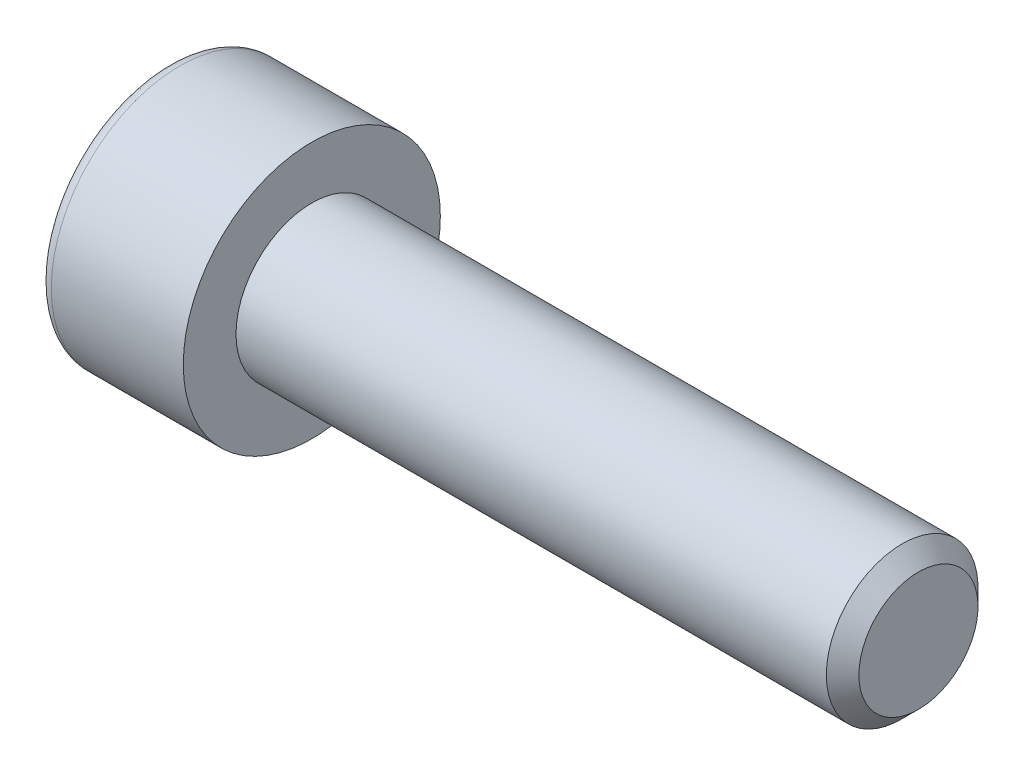
ISO-10303-21;
HEADER;
FILE_DESCRIPTION(('STEP AP214'),'2;1');
FILE_NAME('part.step','',(''),(''),'','','');
FILE_SCHEMA(('AUTOMOTIVE_DESIGN { 1 0 10303 214 1 1 1 1 }'));
ENDSEC;
DATA;
#1=APPLICATION_CONTEXT('core data for automotive mechanical design processes');
#2=APPLICATION_PROTOCOL_DEFINITION('international standard','automotive_design',2000,#1);
#3=PRODUCT_CONTEXT('',#1,'mechanical');
#4=PRODUCT('Part','Part','',(#3));
#5=PRODUCT_RELATED_PRODUCT_CATEGORY('part','',(#4));
#6=PRODUCT_DEFINITION_FORMATION('','',#4);
#7=PRODUCT_DEFINITION_CONTEXT('part definition',#1,'design');
#8=PRODUCT_DEFINITION('design','',#6,#7);
#9=PRODUCT_DEFINITION_SHAPE('','',#8);
#10=(LENGTH_UNIT() NAMED_UNIT(*) SI_UNIT(.MILLI.,.METRE.));
#11=(NAMED_UNIT(*) PLANE_ANGLE_UNIT() SI_UNIT($,.RADIAN.));
#12=(NAMED_UNIT(*) SI_UNIT($,.STERADIAN.) SOLID_ANGLE_UNIT());
#13=UNCERTAINTY_MEASURE_WITH_UNIT(LENGTH_MEASURE(1.E-05),#10,'distance_accuracy_value','');
#14=(GEOMETRIC_REPRESENTATION_CONTEXT(3) GLOBAL_UNCERTAINTY_ASSIGNED_CONTEXT((#13)) GLOBAL_UNIT_ASSIGNED_CONTEXT((#10,
#11,#12)) REPRESENTATION_CONTEXT('',''));
#15=CARTESIAN_POINT('',(0.,0.,0.));
#16=DIRECTION('',(0.,0.,1.));
#17=DIRECTION('',(1.,0.,0.));
#18=AXIS2_PLACEMENT_3D('',#15,#16,#17);
#19=CARTESIAN_POINT('',(0.,0.,0.));
#20=DIRECTION('',(-1.,0.,0.));
#21=DIRECTION('',(0.,0.,1.));
#22=AXIS2_PLACEMENT_3D('',#19,#20,#21);
#23=PLANE('',#22);
#24=CARTESIAN_POINT('',(0.,0.,0.));
#25=DIRECTION('',(-1.,0.,0.));
#26=DIRECTION('',(0.,0.,1.));
#27=AXIS2_PLACEMENT_3D('',#24,#25,#26);
#28=CIRCLE('',#27,3.39);
#29=CARTESIAN_POINT('',(0.,0.,3.39));
#30=VERTEX_POINT('',#29);
#31=EDGE_CURVE('E107',#30,#30,#28,.T.);
#32=ORIENTED_EDGE('',*,*,#31,.F.);
#33=EDGE_LOOP('',(#32));
#34=FACE_BOUND('',#33,.T.);
#35=CARTESIAN_POINT('',(0.,0.,0.));
#36=DIRECTION('',(-1.,0.,0.));
#37=DIRECTION('',(0.,0.,1.));
#38=AXIS2_PLACEMENT_3D('',#35,#36,#37);
#39=CIRCLE('',#38,2.);
#40=CARTESIAN_POINT('',(0.,0.,2.));
#41=VERTEX_POINT('',#40);
#42=EDGE_CURVE('E9',#41,#41,#39,.F.);
#43=ORIENTED_EDGE('',*,*,#42,.F.);
#44=EDGE_LOOP('',(#43));
#45=FACE_BOUND('',#44,.T.);
#46=ADVANCED_FACE('F15',(#34,#45),#23,.F.);
#47=CARTESIAN_POINT('',(-3.82,3.051,0.));
#48=DIRECTION('',(1.,0.,0.));
#49=DIRECTION('',(0.,0.,-1.));
#50=AXIS2_PLACEMENT_3D('',#47,#48,#49);
#51=PLANE('',#50);
#52=CARTESIAN_POINT('',(-3.82,0.,0.));
#53=DIRECTION('',(-1.,0.,0.));
#54=DIRECTION('',(0.,0.,1.));
#55=AXIS2_PLACEMENT_3D('',#52,#53,#54);
#56=CIRCLE('',#55,3.051);
#57=CARTESIAN_POINT('',(-3.82,0.,3.051));
#58=VERTEX_POINT('',#57);
#59=EDGE_CURVE('E90',#58,#58,#56,.T.);
#60=ORIENTED_EDGE('',*,*,#59,.T.);
#61=EDGE_LOOP('',(#60));
#62=FACE_BOUND('',#61,.T.);
#63=DIRECTION('',(0.,0.5,0.866025403784439));
#64=VECTOR('',#63,1.);
#65=CARTESIAN_POINT('',(-3.82,-0.536288105676657,2.07112175347316));
#66=LINE('',#65,#64);
#67=CARTESIAN_POINT('',(-3.82,-1.73205080756888,0.));
#68=VERTEX_POINT('',#67);
#69=CARTESIAN_POINT('',(-3.82,-0.866025403784438,1.5));
#70=VERTEX_POINT('',#69);
#71=EDGE_CURVE('E24',#68,#70,#66,.T.);
#72=ORIENTED_EDGE('',*,*,#71,.F.);
#73=DIRECTION('',(0.,-0.5,0.866025403784439));
#74=VECTOR('',#73,1.);
#75=CARTESIAN_POINT('',(-3.82,-0.536288105676658,-2.07112175347316));
#76=LINE('',#75,#74);
#77=CARTESIAN_POINT('',(-3.82,-0.866025403784439,-1.5));
#78=VERTEX_POINT('',#77);
#79=EDGE_CURVE('E39',#78,#68,#76,.T.);
#80=ORIENTED_EDGE('',*,*,#79,.F.);
#81=DIRECTION('',(0.,-1.,0.));
#82=VECTOR('',#81,1.);
#83=CARTESIAN_POINT('',(-3.82,3.051,-1.5));
#84=LINE('',#83,#82);
#85=CARTESIAN_POINT('',(-3.82,0.866025403784438,-1.5));
#86=VERTEX_POINT('',#85);
#87=EDGE_CURVE('E120',#86,#78,#84,.T.);
#88=ORIENTED_EDGE('',*,*,#87,.F.);
#89=DIRECTION('',(0.,-0.5,-0.866025403784439));
#90=VECTOR('',#89,1.);
#91=CARTESIAN_POINT('',(-3.82,2.06178810567666,0.571121753473161));
#92=LINE('',#91,#90);
#93=CARTESIAN_POINT('',(-3.82,1.73205080756887,0.));
#94=VERTEX_POINT('',#93);
#95=EDGE_CURVE('E117',#94,#86,#92,.T.);
#96=ORIENTED_EDGE('',*,*,#95,.F.);
#97=DIRECTION('',(0.,0.5,-0.866025403784439));
#98=VECTOR('',#97,1.);
#99=CARTESIAN_POINT('',(-3.82,2.06178810567665,-0.571121753473161));
#100=LINE('',#99,#98);
#101=CARTESIAN_POINT('',(-3.82,0.866025403784439,1.5));
#102=VERTEX_POINT('',#101);
#103=EDGE_CURVE('E114',#102,#94,#100,.T.);
#104=ORIENTED_EDGE('',*,*,#103,.F.);
#105=DIRECTION('',(0.,1.,0.));
#106=VECTOR('',#105,1.);
#107=CARTESIAN_POINT('',(-3.82,3.051,1.5));
#108=LINE('',#107,#106);
#109=EDGE_CURVE('E111',#70,#102,#108,.T.);
#110=ORIENTED_EDGE('',*,*,#109,.F.);
#111=EDGE_LOOP('',(#72,#80,#88,#96,#104,#110));
#112=FACE_BOUND('',#111,.T.);
#113=ADVANCED_FACE('F17',(#62,#112),#51,.F.);
#114=CARTESIAN_POINT('',(-3.82,0.,0.));
#115=DIRECTION('',(-1.,0.,0.));
#116=DIRECTION('',(0.,0.,1.));
#117=AXIS2_PLACEMENT_3D('',#114,#115,#116);
#118=CYLINDRICAL_SURFACE('',#117,3.39);
#119=CARTESIAN_POINT('',(-3.481,0.,0.));
#120=DIRECTION('',(-1.,0.,0.));
#121=DIRECTION('',(0.,0.,1.));
#122=AXIS2_PLACEMENT_3D('',#119,#120,#121);
#123=CIRCLE('',#122,3.39);
#124=CARTESIAN_POINT('',(-3.481,0.,3.39));
#125=VERTEX_POINT('',#124);
#126=EDGE_CURVE('E97',#125,#125,#123,.T.);
#127=ORIENTED_EDGE('',*,*,#126,.F.);
#128=EDGE_LOOP('',(#127));
#129=FACE_BOUND('',#128,.T.);
#130=ORIENTED_EDGE('',*,*,#31,.T.);
#131=EDGE_LOOP('',(#130));
#132=FACE_BOUND('',#131,.T.);
#133=ADVANCED_FACE('F201',(#129,#132),#118,.T.);
#134=CARTESIAN_POINT('',(-3.481,0.,0.));
#135=DIRECTION('',(-1.,0.,0.));
#136=DIRECTION('',(0.,0.,1.));
#137=AXIS2_PLACEMENT_3D('',#134,#135,#136);
#138=TOROIDAL_SURFACE('',#137,3.051,0.339);
#139=ORIENTED_EDGE('',*,*,#59,.F.);
#140=EDGE_LOOP('',(#139));
#141=FACE_BOUND('',#140,.T.);
#142=ORIENTED_EDGE('',*,*,#126,.T.);
#143=EDGE_LOOP('',(#142));
#144=FACE_BOUND('',#143,.T.);
#145=ADVANCED_FACE('F208',(#141,#144),#138,.T.);
#146=CARTESIAN_POINT('',(-1.82,-0.866025403784437,1.5));
#147=DIRECTION('',(0.,0.866025403784439,-0.5));
#148=DIRECTION('',(0.,0.5,0.866025403784439));
#149=AXIS2_PLACEMENT_3D('',#146,#147,#148);
#150=PLANE('',#149);
#151=ORIENTED_EDGE('',*,*,#71,.T.);
#152=DIRECTION('',(-1.,0.,0.));
#153=VECTOR('',#152,1.);
#154=CARTESIAN_POINT('',(-1.82,-0.866025403784437,1.5));
#155=LINE('',#154,#153);
#156=CARTESIAN_POINT('',(-1.82,-0.866025403784437,1.5));
#157=VERTEX_POINT('',#156);
#158=EDGE_CURVE('E31',#157,#70,#155,.T.);
#159=ORIENTED_EDGE('',*,*,#158,.F.);
#160=DIRECTION('',(0.,-0.5,-0.866025403784438));
#161=VECTOR('',#160,1.);
#162=CARTESIAN_POINT('',(-1.82,-0.866025403784437,1.5));
#163=LINE('',#162,#161);
#164=CARTESIAN_POINT('',(-1.82,-1.73205080756888,0.));
#165=VERTEX_POINT('',#164);
#166=EDGE_CURVE('E75',#157,#165,#163,.T.);
#167=ORIENTED_EDGE('',*,*,#166,.T.);
#168=DIRECTION('',(-1.,0.,0.));
#169=VECTOR('',#168,1.);
#170=CARTESIAN_POINT('',(-1.82,-1.73205080756888,0.));
#171=LINE('',#170,#169);
#172=EDGE_CURVE('E83',#165,#68,#171,.T.);
#173=ORIENTED_EDGE('',*,*,#172,.T.);
#174=EDGE_LOOP('',(#151,#159,#167,#173));
#175=FACE_BOUND('',#174,.T.);
#176=ADVANCED_FACE('F82',(#175),#150,.T.);
#177=CARTESIAN_POINT('',(-1.82,-1.73205080756888,0.));
#178=DIRECTION('',(0.,0.866025403784439,0.5));
#179=DIRECTION('',(0.,-0.5,0.866025403784439));
#180=AXIS2_PLACEMENT_3D('',#177,#178,#179);
#181=PLANE('',#180);
#182=ORIENTED_EDGE('',*,*,#79,.T.);
#183=ORIENTED_EDGE('',*,*,#172,.F.);
#184=DIRECTION('',(0.,0.5,-0.866025403784439));
#185=VECTOR('',#184,1.);
#186=CARTESIAN_POINT('',(-1.82,-1.73205080756888,0.));
#187=LINE('',#186,#185);
#188=CARTESIAN_POINT('',(-1.82,-0.866025403784439,-1.5));
#189=VERTEX_POINT('',#188);
#190=EDGE_CURVE('E71',#165,#189,#187,.T.);
#191=ORIENTED_EDGE('',*,*,#190,.T.);
#192=DIRECTION('',(-1.,0.,0.));
#193=VECTOR('',#192,1.);
#194=CARTESIAN_POINT('',(-1.82,-0.866025403784439,-1.5));
#195=LINE('',#194,#193);
#196=EDGE_CURVE('E91',#189,#78,#195,.T.);
#197=ORIENTED_EDGE('',*,*,#196,.T.);
#198=EDGE_LOOP('',(#182,#183,#191,#197));
#199=FACE_BOUND('',#198,.T.);
#200=ADVANCED_FACE('F88',(#199),#181,.T.);
#201=CARTESIAN_POINT('',(-1.82,-0.866025403784439,-1.5));
#202=DIRECTION('',(0.,0.,1.));
#203=DIRECTION('',(0.,-1.,0.));
#204=AXIS2_PLACEMENT_3D('',#201,#202,#203);
#205=PLANE('',#204);
#206=ORIENTED_EDGE('',*,*,#87,.T.);
#207=ORIENTED_EDGE('',*,*,#196,.F.);
#208=DIRECTION('',(0.,1.,0.));
#209=VECTOR('',#208,1.);
#210=CARTESIAN_POINT('',(-1.82,-0.866025403784439,-1.5));
#211=LINE('',#210,#209);
#212=CARTESIAN_POINT('',(-1.82,0.866025403784438,-1.5));
#213=VERTEX_POINT('',#212);
#214=EDGE_CURVE('E77',#189,#213,#211,.T.);
#215=ORIENTED_EDGE('',*,*,#214,.T.);
#216=DIRECTION('',(-1.,0.,0.));
#217=VECTOR('',#216,1.);
#218=CARTESIAN_POINT('',(-1.82,0.866025403784438,-1.5));
#219=LINE('',#218,#217);
#220=EDGE_CURVE('E100',#213,#86,#219,.T.);
#221=ORIENTED_EDGE('',*,*,#220,.T.);
#222=EDGE_LOOP('',(#206,#207,#215,#221));
#223=FACE_BOUND('',#222,.T.);
#224=ADVANCED_FACE('F159',(#223),#205,.T.);
#225=CARTESIAN_POINT('',(-1.82,0.866025403784438,-1.5));
#226=DIRECTION('',(0.,-0.866025403784439,0.5));
#227=DIRECTION('',(0.,-0.5,-0.866025403784439));
#228=AXIS2_PLACEMENT_3D('',#225,#226,#227);
#229=PLANE('',#228);
#230=ORIENTED_EDGE('',*,*,#95,.T.);
#231=ORIENTED_EDGE('',*,*,#220,.F.);
#232=DIRECTION('',(0.,0.5,0.866025403784439));
#233=VECTOR('',#232,1.);
#234=CARTESIAN_POINT('',(-1.82,0.866025403784438,-1.5));
#235=LINE('',#234,#233);
#236=CARTESIAN_POINT('',(-1.82,1.73205080756887,0.));
#237=VERTEX_POINT('',#236);
#238=EDGE_CURVE('E162',#213,#237,#235,.T.);
#239=ORIENTED_EDGE('',*,*,#238,.T.);
#240=DIRECTION('',(-1.,0.,0.));
#241=VECTOR('',#240,1.);
#242=CARTESIAN_POINT('',(-1.82,1.73205080756887,0.));
#243=LINE('',#242,#241);
#244=EDGE_CURVE('E141',#237,#94,#243,.T.);
#245=ORIENTED_EDGE('',*,*,#244,.T.);
#246=EDGE_LOOP('',(#230,#231,#239,#245));
#247=FACE_BOUND('',#246,.T.);
#248=ADVANCED_FACE('F161',(#247),#229,.T.);
#249=CARTESIAN_POINT('',(-1.82,1.73205080756888,0.));
#250=DIRECTION('',(0.,-0.866025403784439,-0.5));
#251=DIRECTION('',(0.,0.5,-0.866025403784439));
#252=AXIS2_PLACEMENT_3D('',#249,#250,#251);
#253=PLANE('',#252);
#254=ORIENTED_EDGE('',*,*,#103,.T.);
#255=ORIENTED_EDGE('',*,*,#244,.F.);
#256=DIRECTION('',(0.,-0.5,0.866025403784439));
#257=VECTOR('',#256,1.);
#258=CARTESIAN_POINT('',(-1.82,1.73205080756888,0.));
#259=LINE('',#258,#257);
#260=CARTESIAN_POINT('',(-1.82,0.866025403784439,1.5));
#261=VERTEX_POINT('',#260);
#262=EDGE_CURVE('E139',#237,#261,#259,.T.);
#263=ORIENTED_EDGE('',*,*,#262,.T.);
#264=DIRECTION('',(-1.,0.,0.));
#265=VECTOR('',#264,1.);
#266=CARTESIAN_POINT('',(-1.82,0.866025403784439,1.5));
#267=LINE('',#266,#265);
#268=EDGE_CURVE('E133',#261,#102,#267,.T.);
#269=ORIENTED_EDGE('',*,*,#268,.T.);
#270=EDGE_LOOP('',(#254,#255,#263,#269));
#271=FACE_BOUND('',#270,.T.);
#272=ADVANCED_FACE('F135',(#271),#253,.T.);
#273=CARTESIAN_POINT('',(-1.82,0.86602540378444,1.5));
#274=DIRECTION('',(0.,0.,-1.));
#275=DIRECTION('',(0.,1.,0.));
#276=AXIS2_PLACEMENT_3D('',#273,#274,#275);
#277=PLANE('',#276);
#278=ORIENTED_EDGE('',*,*,#109,.T.);
#279=ORIENTED_EDGE('',*,*,#268,.F.);
#280=DIRECTION('',(0.,-1.,0.));
#281=VECTOR('',#280,1.);
#282=CARTESIAN_POINT('',(-1.82,0.86602540378444,1.5));
#283=LINE('',#282,#281);
#284=EDGE_CURVE('E149',#261,#157,#283,.T.);
#285=ORIENTED_EDGE('',*,*,#284,.T.);
#286=ORIENTED_EDGE('',*,*,#158,.T.);
#287=EDGE_LOOP('',(#278,#279,#285,#286));
#288=FACE_BOUND('',#287,.T.);
#289=ADVANCED_FACE('F132',(#288),#277,.T.);
#290=CARTESIAN_POINT('',(-1.82,-1.73205080756888,0.));
#291=DIRECTION('',(1.,0.,0.));
#292=DIRECTION('',(0.,0.,1.));
#293=AXIS2_PLACEMENT_3D('',#290,#291,#292);
#294=PLANE('',#293);
#295=ORIENTED_EDGE('',*,*,#166,.F.);
#296=ORIENTED_EDGE('',*,*,#284,.F.);
#297=ORIENTED_EDGE('',*,*,#262,.F.);
#298=ORIENTED_EDGE('',*,*,#238,.F.);
#299=ORIENTED_EDGE('',*,*,#214,.F.);
#300=ORIENTED_EDGE('',*,*,#190,.F.);
#301=EDGE_LOOP('',(#295,#296,#297,#298,#299,#300));
#302=FACE_BOUND('',#301,.T.);
#303=ADVANCED_FACE('F73',(#302),#294,.F.);
#304=CARTESIAN_POINT('',(0.,0.,0.));
#305=DIRECTION('',(-1.,0.,0.));
#306=DIRECTION('',(0.,0.,1.));
#307=AXIS2_PLACEMENT_3D('',#304,#305,#306);
#308=CYLINDRICAL_SURFACE('',#307,2.);
#309=CARTESIAN_POINT('',(15.5705,0.,0.));
#310=DIRECTION('',(-1.,0.,0.));
#311=DIRECTION('',(0.,0.,1.));
#312=AXIS2_PLACEMENT_3D('',#309,#310,#311);
#313=CIRCLE('',#312,2.);
#314=CARTESIAN_POINT('',(15.5705,0.,2.));
#315=VERTEX_POINT('',#314);
#316=EDGE_CURVE('E172',#315,#315,#313,.T.);
#317=ORIENTED_EDGE('',*,*,#316,.T.);
#318=EDGE_LOOP('',(#317));
#319=FACE_BOUND('',#318,.T.);
#320=ORIENTED_EDGE('',*,*,#42,.T.);
#321=EDGE_LOOP('',(#320));
#322=FACE_BOUND('',#321,.T.);
#323=ADVANCED_FACE('F178',(#319,#322),#308,.T.);
#324=CARTESIAN_POINT('',(16.,0.,0.));
#325=DIRECTION('',(-1.,0.,0.));
#326=DIRECTION('',(0.,0.,1.));
#327=AXIS2_PLACEMENT_3D('',#324,#325,#326);
#328=PLANE('',#327);
#329=CARTESIAN_POINT('',(16.,0.,0.));
#330=DIRECTION('',(-1.,0.,0.));
#331=DIRECTION('',(0.,0.,1.));
#332=AXIS2_PLACEMENT_3D('',#329,#330,#331);
#333=CIRCLE('',#332,1.5705);
#334=CARTESIAN_POINT('',(16.,0.,1.5705));
#335=VERTEX_POINT('',#334);
#336=EDGE_CURVE('E86',#335,#335,#333,.T.);
#337=ORIENTED_EDGE('',*,*,#336,.F.);
#338=EDGE_LOOP('',(#337));
#339=FACE_BOUND('',#338,.T.);
#340=ADVANCED_FACE('F184',(#339),#328,.F.);
#341=CARTESIAN_POINT('',(16.,0.,0.));
#342=DIRECTION('',(-1.,0.,0.));
#343=DIRECTION('',(0.,0.,1.));
#344=AXIS2_PLACEMENT_3D('',#341,#342,#343);
#345=CONICAL_SURFACE('',#344,1.5705,0.785398163397448);
#346=ORIENTED_EDGE('',*,*,#316,.F.);
#347=EDGE_LOOP('',(#346));
#348=FACE_BOUND('',#347,.T.);
#349=ORIENTED_EDGE('',*,*,#336,.T.);
#350=EDGE_LOOP('',(#349));
#351=FACE_BOUND('',#350,.T.);
#352=ADVANCED_FACE('F181',(#348,#351),#345,.T.);
#353=CLOSED_SHELL('',(#46,#113,#133,#145,#176,#200,#224,#248,#272,#289,#303,#323,#340,#352));
#354=MANIFOLD_SOLID_BREP('B1',#353);
#355=ADVANCED_BREP_SHAPE_REPRESENTATION('',(#18,#354),#14);
#356=SHAPE_DEFINITION_REPRESENTATION(#9,#355);
ENDSEC;
END-ISO-10303-21;
